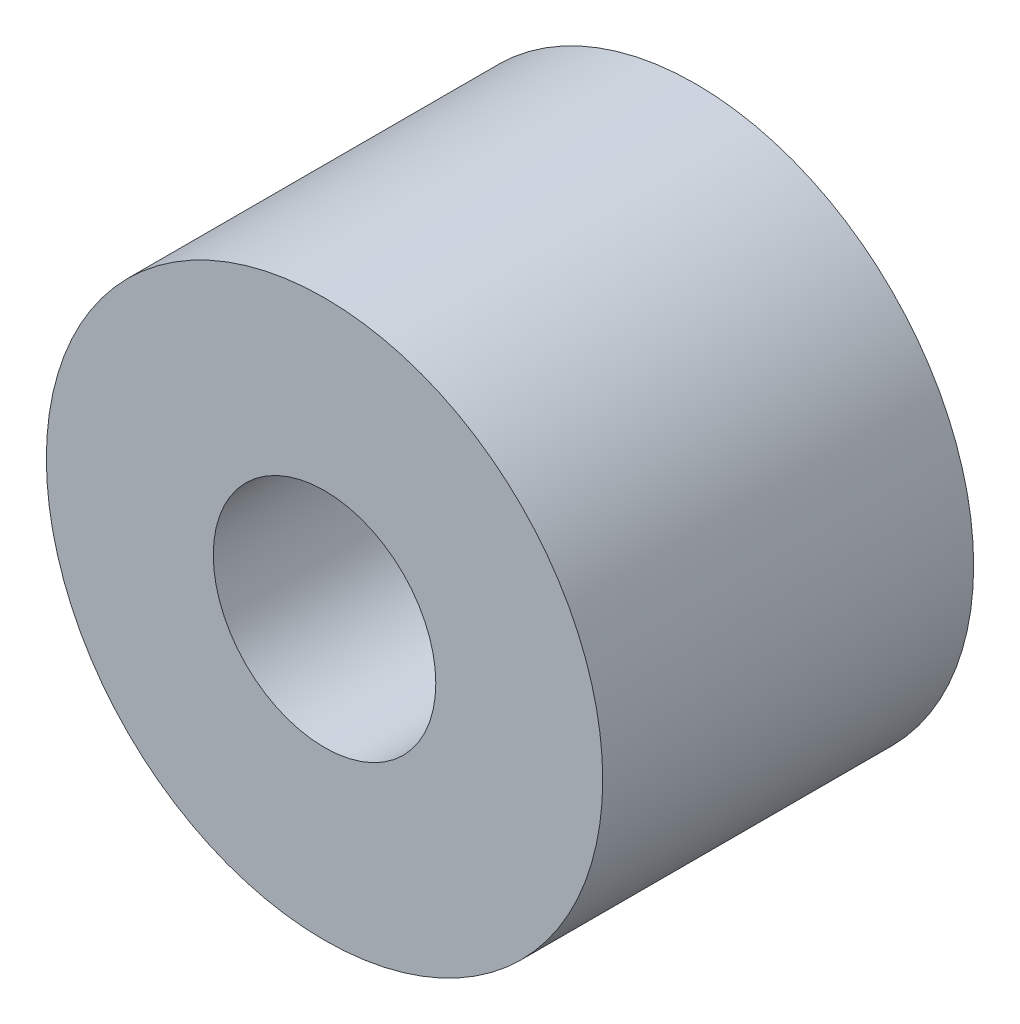
ISO-10303-21;
HEADER;
FILE_DESCRIPTION(('STEP AP214'),'2;1');
FILE_NAME('part.step','',(''),(''),'','','');
FILE_SCHEMA(('AUTOMOTIVE_DESIGN { 1 0 10303 214 1 1 1 1 }'));
ENDSEC;
DATA;
#1=APPLICATION_CONTEXT('core data for automotive mechanical design processes');
#2=APPLICATION_PROTOCOL_DEFINITION('international standard','automotive_design',2000,#1);
#3=PRODUCT_CONTEXT('',#1,'mechanical');
#4=PRODUCT('Part','Part','',(#3));
#5=PRODUCT_RELATED_PRODUCT_CATEGORY('part','',(#4));
#6=PRODUCT_DEFINITION_FORMATION('','',#4);
#7=PRODUCT_DEFINITION_CONTEXT('part definition',#1,'design');
#8=PRODUCT_DEFINITION('design','',#6,#7);
#9=PRODUCT_DEFINITION_SHAPE('','',#8);
#10=(LENGTH_UNIT() NAMED_UNIT(*) SI_UNIT(.MILLI.,.METRE.));
#11=(NAMED_UNIT(*) PLANE_ANGLE_UNIT() SI_UNIT($,.RADIAN.));
#12=(NAMED_UNIT(*) SI_UNIT($,.STERADIAN.) SOLID_ANGLE_UNIT());
#13=UNCERTAINTY_MEASURE_WITH_UNIT(LENGTH_MEASURE(1.E-05),#10,'distance_accuracy_value','');
#14=(GEOMETRIC_REPRESENTATION_CONTEXT(3) GLOBAL_UNCERTAINTY_ASSIGNED_CONTEXT((#13)) GLOBAL_UNIT_ASSIGNED_CONTEXT((#10,
#11,#12)) REPRESENTATION_CONTEXT('',''));
#15=CARTESIAN_POINT('',(0.,0.,0.));
#16=DIRECTION('',(0.,0.,1.));
#17=DIRECTION('',(1.,0.,0.));
#18=AXIS2_PLACEMENT_3D('',#15,#16,#17);
#19=CARTESIAN_POINT('',(0.,0.,30.));
#20=DIRECTION('',(0.,0.,1.));
#21=DIRECTION('',(1.,0.,0.));
#22=AXIS2_PLACEMENT_3D('',#19,#20,#21);
#23=PLANE('',#22);
#24=CARTESIAN_POINT('',(0.,0.,30.));
#25=DIRECTION('',(0.,0.,1.));
#26=DIRECTION('',(1.,0.,0.));
#27=AXIS2_PLACEMENT_3D('',#24,#25,#26);
#28=CIRCLE('',#27,22.5);
#29=CARTESIAN_POINT('',(22.5,0.,30.));
#30=VERTEX_POINT('',#29);
#31=EDGE_CURVE('E10',#30,#30,#28,.T.);
#32=ORIENTED_EDGE('',*,*,#31,.T.);
#33=EDGE_LOOP('',(#32));
#34=FACE_BOUND('',#33,.T.);
#35=CARTESIAN_POINT('',(0.,0.,30.));
#36=DIRECTION('',(0.,0.,1.));
#37=DIRECTION('',(1.,0.,0.));
#38=AXIS2_PLACEMENT_3D('',#35,#36,#37);
#39=CIRCLE('',#38,9.);
#40=CARTESIAN_POINT('',(9.,0.,30.));
#41=VERTEX_POINT('',#40);
#42=EDGE_CURVE('E43',#41,#41,#39,.T.);
#43=ORIENTED_EDGE('',*,*,#42,.F.);
#44=EDGE_LOOP('',(#43));
#45=FACE_BOUND('',#44,.T.);
#46=ADVANCED_FACE('F31',(#34,#45),#23,.T.);
#47=CARTESIAN_POINT('',(0.,0.,0.));
#48=DIRECTION('',(0.,0.,1.));
#49=DIRECTION('',(1.,0.,0.));
#50=AXIS2_PLACEMENT_3D('',#47,#48,#49);
#51=PLANE('',#50);
#52=CARTESIAN_POINT('',(0.,0.,0.));
#53=DIRECTION('',(0.,0.,1.));
#54=DIRECTION('',(1.,0.,0.));
#55=AXIS2_PLACEMENT_3D('',#52,#53,#54);
#56=CIRCLE('',#55,22.5);
#57=CARTESIAN_POINT('',(22.5,0.,0.));
#58=VERTEX_POINT('',#57);
#59=EDGE_CURVE('E36',#58,#58,#56,.T.);
#60=ORIENTED_EDGE('',*,*,#59,.F.);
#61=EDGE_LOOP('',(#60));
#62=FACE_BOUND('',#61,.T.);
#63=CARTESIAN_POINT('',(0.,0.,0.));
#64=DIRECTION('',(0.,0.,1.));
#65=DIRECTION('',(1.,0.,0.));
#66=AXIS2_PLACEMENT_3D('',#63,#64,#65);
#67=CIRCLE('',#66,9.);
#68=CARTESIAN_POINT('',(9.,0.,0.));
#69=VERTEX_POINT('',#68);
#70=EDGE_CURVE('E45',#69,#69,#67,.T.);
#71=ORIENTED_EDGE('',*,*,#70,.T.);
#72=EDGE_LOOP('',(#71));
#73=FACE_BOUND('',#72,.T.);
#74=ADVANCED_FACE('F69',(#62,#73),#51,.F.);
#75=CARTESIAN_POINT('',(0.,0.,30.));
#76=DIRECTION('',(0.,0.,-1.));
#77=DIRECTION('',(-1.,0.,0.));
#78=AXIS2_PLACEMENT_3D('',#75,#76,#77);
#79=CYLINDRICAL_SURFACE('',#78,22.5);
#80=CARTESIAN_POINT('',(0.,-22.5,13.));
#81=CARTESIAN_POINT('',(0.167713253503927,-22.4999975361382,12.9999929354396));
#82=CARTESIAN_POINT('',(0.33552896891442,-22.4981050609079,12.9858886930563));
#83=CARTESIAN_POINT('',(0.666484087707118,-22.4907376669036,12.9298504764257));
#84=CARTESIAN_POINT('',(0.829618533499555,-22.4852590866259,12.8878880576543));
#85=CARTESIAN_POINT('',(1.14637246894048,-22.471336197736,12.7773974236878));
#86=CARTESIAN_POINT('',(1.29999852458774,-22.4628939631646,12.7088877834423));
#87=CARTESIAN_POINT('',(1.59354584254545,-22.4439807999059,12.5472896292906));
#88=CARTESIAN_POINT('',(1.73346930950554,-22.4335101983785,12.4542050782503));
#89=CARTESIAN_POINT('',(1.99653873375702,-22.4116349218495,12.2454801075937));
#90=CARTESIAN_POINT('',(2.1195869782438,-22.4002253724317,12.1297170324873));
#91=CARTESIAN_POINT('',(2.34457103509653,-22.3777970633693,11.879184716385));
#92=CARTESIAN_POINT('',(2.44650572995832,-22.3667783244351,11.7444144700063));
#93=CARTESIAN_POINT('',(2.62673853403361,-22.3463315316028,11.4590513155825));
#94=CARTESIAN_POINT('',(2.70494411223867,-22.3369097664864,11.3083994762821));
#95=CARTESIAN_POINT('',(2.83490767510935,-22.3207888106885,10.9959533991448));
#96=CARTESIAN_POINT('',(2.88666679867917,-22.3140895027681,10.83415964147));
#97=CARTESIAN_POINT('',(2.96196910158261,-22.30421904853,10.5050412842475));
#98=CARTESIAN_POINT('',(2.9856780634276,-22.301027180552,10.3377552482006));
#99=CARTESIAN_POINT('',(3.00472020822176,-22.2984697741397,10.0015507305911));
#100=CARTESIAN_POINT('',(3.00005468450402,-22.299104061306,9.83263232378365));
#101=CARTESIAN_POINT('',(2.96261618908852,-22.3041083365948,9.4991183049581));
#102=CARTESIAN_POINT('',(2.93002646297642,-22.3084539693351,9.33450170517144));
#103=CARTESIAN_POINT('',(2.83795086951557,-22.3203532916212,9.01309474485986));
#104=CARTESIAN_POINT('',(2.77846438892186,-22.3279070543119,8.85630456286748));
#105=CARTESIAN_POINT('',(2.63408893714787,-22.3453989166654,8.5544355479392));
#106=CARTESIAN_POINT('',(2.54912096870624,-22.3553444118585,8.40939494320854));
#107=CARTESIAN_POINT('',(2.35625090016434,-22.376493543299,8.13556137712351));
#108=CARTESIAN_POINT('',(2.24834760753577,-22.3876972449529,8.00676926116875));
#109=CARTESIAN_POINT('',(2.01165735039543,-22.4102084885038,7.76802548112715));
#110=CARTESIAN_POINT('',(1.88271256053967,-22.421516153118,7.65823023594651));
#111=CARTESIAN_POINT('',(1.60814125520011,-22.442878857274,7.46181693260741));
#112=CARTESIAN_POINT('',(1.46251469166355,-22.4529338932073,7.37519894121472));
#113=CARTESIAN_POINT('',(1.1585883295957,-22.4706659061537,7.22759632345789));
#114=CARTESIAN_POINT('',(1.00028336826184,-22.4783419081344,7.16662220343053));
#115=CARTESIAN_POINT('',(0.675556386504371,-22.4904423885611,7.07216602154148));
#116=CARTESIAN_POINT('',(0.509134799313383,-22.4948670403489,7.03868249404091));
#117=CARTESIAN_POINT('',(0.174250354988463,-22.4999436206528,7.00036235084332));
#118=CARTESIAN_POINT('',(0.00581255182056085,-22.5006239077357,6.99531039732477));
#119=CARTESIAN_POINT('',(-0.329507425828079,-22.4982118730778,7.01342749619077));
#120=CARTESIAN_POINT('',(-0.496389638018499,-22.495119643029,7.03659586267354));
#121=CARTESIAN_POINT('',(-0.82322057335941,-22.4855276303715,7.11031698007598));
#122=CARTESIAN_POINT('',(-0.98319302476807,-22.4790407145438,7.16076635248323));
#123=CARTESIAN_POINT('',(-1.29240764819034,-22.4633851388143,7.28750944890563));
#124=CARTESIAN_POINT('',(-1.44164941052346,-22.4542163765916,7.36380415901988));
#125=CARTESIAN_POINT('',(-1.72612331792412,-22.4341475605511,7.54058823337497));
#126=CARTESIAN_POINT('',(-1.86126872159491,-22.4232377256857,7.64121604857));
#127=CARTESIAN_POINT('',(-2.11282942048785,-22.4009359306497,7.86361499383638));
#128=CARTESIAN_POINT('',(-2.22924386493568,-22.3895439486093,7.98538708377465));
#129=CARTESIAN_POINT('',(-2.44080824134647,-22.3674735371027,8.24756971395933));
#130=CARTESIAN_POINT('',(-2.53581491413408,-22.3568002316295,8.38809635010724));
#131=CARTESIAN_POINT('',(-2.70087526618221,-22.3374619950273,8.68323911542139));
#132=CARTESIAN_POINT('',(-2.7709295026552,-22.3287970190518,8.83785492986557));
#133=CARTESIAN_POINT('',(-2.88386754751119,-22.3144921767012,9.15633586304154));
#134=CARTESIAN_POINT('',(-2.92683043270193,-22.308843513489,9.32017252781621));
#135=CARTESIAN_POINT('',(-2.98462000715938,-22.3011862304744,9.65281544819314));
#136=CARTESIAN_POINT('',(-2.99944820140173,-22.2991774159701,9.82162143748666));
#137=CARTESIAN_POINT('',(-3.00051728709284,-22.2990334694317,10.1579852362803));
#138=CARTESIAN_POINT('',(-2.98698328791739,-22.3008678342378,10.3255423614464));
#139=CARTESIAN_POINT('',(-2.93219065030034,-22.308137758113,10.6559768126558));
#140=CARTESIAN_POINT('',(-2.89093202224903,-22.3135733158325,10.818854140453));
#141=CARTESIAN_POINT('',(-2.78193465498311,-22.3274233540915,11.1352655248774));
#142=CARTESIAN_POINT('',(-2.71420831228562,-22.335836439891,11.2888039166753));
#143=CARTESIAN_POINT('',(-2.55422014139606,-22.3546956856923,11.5823738257391));
#144=CARTESIAN_POINT('',(-2.46195783945643,-22.365141884949,11.7224050821341));
#145=CARTESIAN_POINT('',(-2.25468672764262,-22.3869895077459,11.9861344748926));
#146=CARTESIAN_POINT('',(-2.13951040840351,-22.3983975863112,12.1097004216327));
#147=CARTESIAN_POINT('',(-1.89003254024735,-22.4208257850249,12.3358348245423));
#148=CARTESIAN_POINT('',(-1.75572651109466,-22.4318458135347,12.4383983481254));
#149=CARTESIAN_POINT('',(-1.47112948177923,-22.4523095270629,12.6200007076998));
#150=CARTESIAN_POINT('',(-1.32077193111595,-22.4617461964033,12.6989359998329));
#151=CARTESIAN_POINT('',(-1.00888861438099,-22.4779098098846,12.8303208978176));
#152=CARTESIAN_POINT('',(-0.847375018454831,-22.4846396538647,12.8827988629373));
#153=CARTESIAN_POINT('',(-0.570882612147626,-22.493035826149,12.9474220095778));
#154=CARTESIAN_POINT('',(-0.457636622933667,-22.4956344545261,12.9671098652855));
#155=CARTESIAN_POINT('',(-0.229609757424167,-22.4991173773616,12.9934012212482));
#156=CARTESIAN_POINT('',(-0.11482889467686,-22.500001686942,13.0000048369204));
#157=CARTESIAN_POINT('',(0.,-22.5,13.));
#158=B_SPLINE_CURVE_WITH_KNOTS('',3,(#80,#81,#82,#83,#84,#85,#86,#87,#88,#89,#90,#91,#92,#93,
#94,#95,#96,#97,#98,#99,#100,#101,#102,#103,#104,#105,#106,#107,#108,#109,#110,#111,#112,#113,
#114,#115,#116,#117,#118,#119,#120,#121,#122,#123,#124,#125,#126,#127,#128,#129,#130,#131,#132,
#133,#134,#135,#136,#137,#138,#139,#140,#141,#142,#143,#144,#145,#146,#147,#148,#149,#150,#151,
#152,#153,#154,#155,#156,#157),.UNSPECIFIED.,.T.,.F.,(4,2,2,2,2,2,2,2,2,2,2,2,2,2,2,2,2,2,2,2,2,
2,2,2,2,2,2,2,2,2,2,2,2,2,2,2,2,2,4),(0.,0.502720276958615,1.00595464632757,1.50883753924111,
2.01163938846052,2.51723967665338,3.02286671857254,3.53044082267471,4.03799306649307,
4.54253033871538,5.04704461387381,5.54827327647066,6.04951336763776,6.55232374706847,
7.05516027665696,7.56195816727274,8.06875751778444,8.57576430303808,9.08274405587615,
9.58587877488092,10.0890012653172,10.590230450947,11.0914787625532,11.5956491215483,
12.0998423738814,12.6073155680318,13.1147774290957,13.6207511210318,14.1266977467545,
14.6286439124494,15.1305898900312,15.6323010555393,16.1340219089385,16.6395550175266,
17.1452067187674,17.6530429001177,18.1603335748863,18.5045360857096,18.8487355602816),.UNSPECIFIED.);
#159=CARTESIAN_POINT('',(0.,-22.5,13.));
#160=VERTEX_POINT('',#159);
#161=EDGE_CURVE('E48',#160,#160,#158,.T.);
#162=ORIENTED_EDGE('',*,*,#161,.T.);
#163=EDGE_LOOP('',(#162));
#164=FACE_BOUND('',#163,.T.);
#165=ORIENTED_EDGE('',*,*,#31,.F.);
#166=EDGE_LOOP('',(#165));
#167=FACE_BOUND('',#166,.T.);
#168=ORIENTED_EDGE('',*,*,#59,.T.);
#169=EDGE_LOOP('',(#168));
#170=FACE_BOUND('',#169,.T.);
#171=ADVANCED_FACE('F33',(#164,#167,#170),#79,.T.);
#172=CARTESIAN_POINT('',(0.,0.,30.));
#173=DIRECTION('',(0.,0.,-1.));
#174=DIRECTION('',(-1.,0.,0.));
#175=AXIS2_PLACEMENT_3D('',#172,#173,#174);
#176=CYLINDRICAL_SURFACE('',#175,9.);
#177=ORIENTED_EDGE('',*,*,#42,.T.);
#178=EDGE_LOOP('',(#177));
#179=FACE_BOUND('',#178,.T.);
#180=ORIENTED_EDGE('',*,*,#70,.F.);
#181=EDGE_LOOP('',(#180));
#182=FACE_BOUND('',#181,.T.);
#183=ADVANCED_FACE('F63',(#179,#182),#176,.F.);
#184=CARTESIAN_POINT('',(0.,-25.,10.));
#185=DIRECTION('',(0.,1.,0.));
#186=DIRECTION('',(0.,0.,1.));
#187=AXIS2_PLACEMENT_3D('',#184,#185,#186);
#188=CYLINDRICAL_SURFACE('',#187,3.);
#189=CARTESIAN_POINT('',(0.,-25.,10.));
#190=DIRECTION('',(0.,1.,0.));
#191=DIRECTION('',(0.,0.,1.));
#192=AXIS2_PLACEMENT_3D('',#189,#190,#191);
#193=CIRCLE('',#192,3.);
#194=CARTESIAN_POINT('',(0.,-25.,13.));
#195=VERTEX_POINT('',#194);
#196=EDGE_CURVE('E56',#195,#195,#193,.T.);
#197=ORIENTED_EDGE('',*,*,#196,.T.);
#198=EDGE_LOOP('',(#197));
#199=FACE_BOUND('',#198,.T.);
#200=ORIENTED_EDGE('',*,*,#161,.F.);
#201=EDGE_LOOP('',(#200));
#202=FACE_BOUND('',#201,.T.);
#203=ADVANCED_FACE('F57',(#199,#202),#188,.T.);
#204=CARTESIAN_POINT('',(0.,-25.,10.));
#205=DIRECTION('',(0.,1.,0.));
#206=DIRECTION('',(0.,0.,1.));
#207=AXIS2_PLACEMENT_3D('',#204,#205,#206);
#208=PLANE('',#207);
#209=ORIENTED_EDGE('',*,*,#196,.F.);
#210=EDGE_LOOP('',(#209));
#211=FACE_BOUND('',#210,.T.);
#212=ADVANCED_FACE('F62',(#211),#208,.F.);
#213=CLOSED_SHELL('',(#46,#74,#171,#183,#203,#212));
#214=MANIFOLD_SOLID_BREP('B2',#213);
#215=ADVANCED_BREP_SHAPE_REPRESENTATION('',(#18,#214),#14);
#216=SHAPE_DEFINITION_REPRESENTATION(#9,#215);
ENDSEC;
END-ISO-10303-21;
